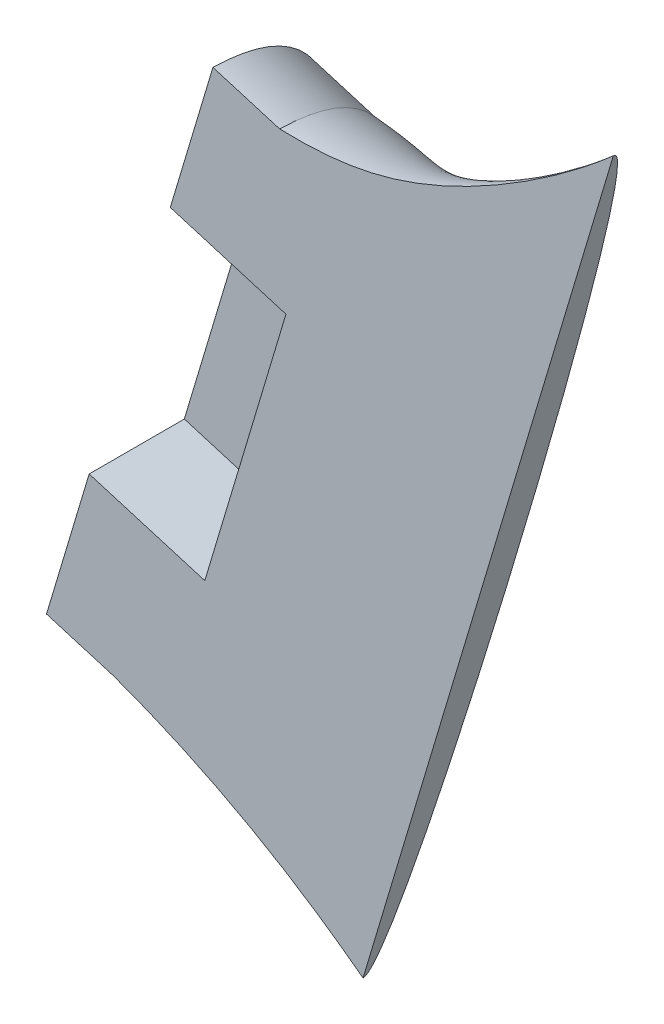
ISO-10303-21;
HEADER;
FILE_DESCRIPTION(('STEP AP214'),'2;1');
FILE_NAME('part.step','',(''),(''),'','','');
FILE_SCHEMA(('AUTOMOTIVE_DESIGN { 1 0 10303 214 1 1 1 1 }'));
ENDSEC;
DATA;
#1=APPLICATION_CONTEXT('core data for automotive mechanical design processes');
#2=APPLICATION_PROTOCOL_DEFINITION('international standard','automotive_design',2000,#1);
#3=PRODUCT_CONTEXT('',#1,'mechanical');
#4=PRODUCT('Part','Part','',(#3));
#5=PRODUCT_RELATED_PRODUCT_CATEGORY('part','',(#4));
#6=PRODUCT_DEFINITION_FORMATION('','',#4);
#7=PRODUCT_DEFINITION_CONTEXT('part definition',#1,'design');
#8=PRODUCT_DEFINITION('design','',#6,#7);
#9=PRODUCT_DEFINITION_SHAPE('','',#8);
#10=(LENGTH_UNIT() NAMED_UNIT(*) SI_UNIT(.MILLI.,.METRE.));
#11=(NAMED_UNIT(*) PLANE_ANGLE_UNIT() SI_UNIT($,.RADIAN.));
#12=(NAMED_UNIT(*) SI_UNIT($,.STERADIAN.) SOLID_ANGLE_UNIT());
#13=UNCERTAINTY_MEASURE_WITH_UNIT(LENGTH_MEASURE(1.E-05),#10,'distance_accuracy_value','');
#14=(GEOMETRIC_REPRESENTATION_CONTEXT(3) GLOBAL_UNCERTAINTY_ASSIGNED_CONTEXT((#13)) GLOBAL_UNIT_ASSIGNED_CONTEXT((#10,
#11,#12)) REPRESENTATION_CONTEXT('',''));
#15=CARTESIAN_POINT('',(0.,0.,0.));
#16=DIRECTION('',(0.,0.,1.));
#17=DIRECTION('',(1.,0.,0.));
#18=AXIS2_PLACEMENT_3D('',#15,#16,#17);
#19=CARTESIAN_POINT('',(-68.8351354727939,20.5796630643947,0.));
#20=DIRECTION('',(0.,0.,-1.));
#21=DIRECTION('',(1.,0.,0.));
#22=AXIS2_PLACEMENT_3D('',#19,#20,#21);
#23=PLANE('',#22);
#24=DIRECTION('',(-0.28644268795493,-0.958097378410543,0.));
#25=VECTOR('',#24,1.);
#26=CARTESIAN_POINT('',(-75.1754818984992,-8.30803292728945,0.));
#27=LINE('',#26,#25);
#28=CARTESIAN_POINT('',(-71.680881105449,3.38075508931917,0.));
#29=VERTEX_POINT('',#28);
#30=CARTESIAN_POINT('',(-75.1754818984992,-8.30803292728945,0.));
#31=VERTEX_POINT('',#30);
#32=EDGE_CURVE('E117',#29,#31,#27,.T.);
#33=ORIENTED_EDGE('',*,*,#32,.T.);
#34=DIRECTION('',(-0.958097378410543,0.28644268795493,0.));
#35=VECTOR('',#34,1.);
#36=CARTESIAN_POINT('',(-75.1754818984992,-8.30803292728945,0.));
#37=LINE('',#36,#35);
#38=CARTESIAN_POINT('',(-80.157588266234,-6.81853094992381,0.));
#39=VERTEX_POINT('',#38);
#40=EDGE_CURVE('E122',#31,#39,#37,.T.);
#41=ORIENTED_EDGE('',*,*,#40,.T.);
#42=DIRECTION('',(0.28644268795493,0.958097378410543,0.));
#43=VECTOR('',#42,1.);
#44=CARTESIAN_POINT('',(-71.7094276080255,21.4389911282595,0.));
#45=LINE('',#44,#43);
#46=CARTESIAN_POINT('',(-81.9945436836104,-12.9628042850572,0.));
#47=VERTEX_POINT('',#46);
#48=EDGE_CURVE('E226',#47,#39,#45,.T.);
#49=ORIENTED_EDGE('',*,*,#48,.F.);
#50=DIRECTION('',(-0.958097378410543,0.28644268795493,0.));
#51=VECTOR('',#50,1.);
#52=CARTESIAN_POINT('',(-79.1202515483788,-13.822132348922,0.));
#53=LINE('',#52,#51);
#54=CARTESIAN_POINT('',(-79.1202515483788,-13.822132348922,0.));
#55=VERTEX_POINT('',#54);
#56=EDGE_CURVE('E49',#55,#47,#53,.T.);
#57=ORIENTED_EDGE('',*,*,#56,.F.);
#58=CARTESIAN_POINT('',(-79.1202515483788,-13.822132348922,0.));
#59=CARTESIAN_POINT('',(-77.2430299362491,-14.4970734561594,0.));
#60=CARTESIAN_POINT('',(-73.2538280253343,-16.3282447215019,0.));
#61=CARTESIAN_POINT('',(-70.0691808052114,-18.4306839193362,0.));
#62=CARTESIAN_POINT('',(-68.3594778518222,-19.7225480436874,0.));
#63=B_SPLINE_CURVE_WITH_KNOTS('',3,(#58,#59,#60,#61,#62),.UNSPECIFIED.,.F.,.F.,(4,1,4),(0.,
0.464218351567374,1.),.UNSPECIFIED.);
#64=CARTESIAN_POINT('',(-68.3594778518222,-19.7225480436874,0.));
#65=VERTEX_POINT('',#64);
#66=EDGE_CURVE('E150',#55,#65,#63,.T.);
#67=ORIENTED_EDGE('',*,*,#66,.T.);
#68=DIRECTION('',(0.286442687954896,0.958097378410553,0.));
#69=VECTOR('',#68,1.);
#70=CARTESIAN_POINT('',(-68.3594778518222,-19.7225480436874,0.));
#71=LINE('',#70,#69);
#72=CARTESIAN_POINT('',(-57.5775416453369,16.3410180657399,0.));
#73=VERTEX_POINT('',#72);
#74=EDGE_CURVE('E197',#65,#73,#71,.T.);
#75=ORIENTED_EDGE('',*,*,#74,.T.);
#76=CARTESIAN_POINT('',(-71.9517399205758,10.1552023379534,0.));
#77=CARTESIAN_POINT('',(-69.5938616061763,10.0813238258005,0.));
#78=CARTESIAN_POINT('',(-65.4570985045668,10.7673698634453,0.));
#79=CARTESIAN_POINT('',(-60.011062756017,14.2052009776582,0.));
#80=CARTESIAN_POINT('',(-57.5775416453369,16.3410180657399,0.));
#81=B_SPLINE_CURVE_WITH_KNOTS('',3,(#76,#77,#78,#79,#80),.UNSPECIFIED.,.F.,.F.,(4,1,4),(0.,
0.464218351567374,1.),.UNSPECIFIED.);
#82=CARTESIAN_POINT('',(-71.9517399205758,10.1552023379534,0.));
#83=VERTEX_POINT('',#82);
#84=EDGE_CURVE('E144',#73,#83,#81,.F.);
#85=ORIENTED_EDGE('',*,*,#84,.T.);
#86=DIRECTION('',(-0.958097378410543,0.28644268795493,0.));
#87=VECTOR('',#86,1.);
#88=CARTESIAN_POINT('',(-71.9517399205758,10.1552023379534,-1.98715659294643E-13));
#89=LINE('',#88,#87);
#90=CARTESIAN_POINT('',(-74.8260320558074,11.0145304018182,-1.99959792391966E-13));
#91=VERTEX_POINT('',#90);
#92=EDGE_CURVE('E11',#83,#91,#89,.T.);
#93=ORIENTED_EDGE('',*,*,#92,.T.);
#94=CARTESIAN_POINT('',(-76.6629874731838,4.87025706668481,0.));
#95=VERTEX_POINT('',#94);
#96=EDGE_CURVE('E210',#95,#91,#45,.T.);
#97=ORIENTED_EDGE('',*,*,#96,.F.);
#98=DIRECTION('',(-0.958097378410543,0.28644268795493,0.));
#99=VECTOR('',#98,1.);
#100=CARTESIAN_POINT('',(-71.680881105449,3.38075508931917,0.));
#101=LINE('',#100,#99);
#102=EDGE_CURVE('E132',#29,#95,#101,.T.);
#103=ORIENTED_EDGE('',*,*,#102,.F.);
#104=EDGE_LOOP('',(#33,#41,#49,#57,#67,#75,#85,#93,#97,#103));
#105=FACE_BOUND('',#104,.T.);
#106=ADVANCED_FACE('F39',(#105),#23,.F.);
#107=CARTESIAN_POINT('',(-71.9517399205757,10.1552023379534,0.));
#108=CARTESIAN_POINT('',(-72.047540179021,9.83476833727145,-10.4883470019912));
#109=CARTESIAN_POINT('',(-78.9396589990728,-13.2180839464793,-10.3872504791322));
#110=CARTESIAN_POINT('',(-79.1202515483788,-13.822132348922,0.));
#111=B_SPLINE_CURVE_WITH_KNOTS('',3,(#107,#108,#109,#110),.UNSPECIFIED.,.F.,.F.,(4,4),(0.,1.),.UNSPECIFIED.);
#112=DIRECTION('',(-0.958097378410543,0.28644268795493,0.));
#113=VECTOR('',#112,1.);
#114=SURFACE_OF_LINEAR_EXTRUSION('',#111,#113);
#115=CARTESIAN_POINT('',(-74.8260320558074,11.0145304018182,0.));
#116=CARTESIAN_POINT('',(-74.9218323142527,10.6940964011362,-10.4883470019912));
#117=CARTESIAN_POINT('',(-81.8139511343044,-12.3587558826146,-10.3872504791322));
#118=CARTESIAN_POINT('',(-81.9945436836104,-12.9628042850572,0.));
#119=B_SPLINE_CURVE_WITH_KNOTS('',3,(#115,#116,#117,#118),.UNSPECIFIED.,.F.,.F.,(4,4),(0.,1.),.UNSPECIFIED.);
#120=EDGE_CURVE('E76',#91,#47,#119,.T.);
#121=ORIENTED_EDGE('',*,*,#120,.F.);
#122=ORIENTED_EDGE('',*,*,#92,.F.);
#123=CARTESIAN_POINT('',(-71.9517399205757,10.1552023379534,0.));
#124=CARTESIAN_POINT('',(-72.047540179021,9.83476833727145,-10.4883470019912));
#125=CARTESIAN_POINT('',(-78.9396589990728,-13.2180839464793,-10.3872504791322));
#126=CARTESIAN_POINT('',(-79.1202515483788,-13.822132348922,0.));
#127=B_SPLINE_CURVE_WITH_KNOTS('',3,(#123,#124,#125,#126),.UNSPECIFIED.,.F.,.F.,(4,4),(0.,1.),.UNSPECIFIED.);
#128=EDGE_CURVE('E66',#83,#55,#127,.T.);
#129=ORIENTED_EDGE('',*,*,#128,.T.);
#130=ORIENTED_EDGE('',*,*,#56,.T.);
#131=EDGE_LOOP('',(#121,#122,#129,#130));
#132=FACE_BOUND('',#131,.T.);
#133=ADVANCED_FACE('F231',(#132),#114,.T.);
#134=CARTESIAN_POINT('',(-71.7094276080255,21.4389911282595,0.));
#135=DIRECTION('',(0.958097378410543,-0.28644268795493,0.));
#136=DIRECTION('',(-0.28644268795493,-0.958097378410543,0.));
#137=AXIS2_PLACEMENT_3D('',#134,#135,#136);
#138=PLANE('',#137);
#139=ORIENTED_EDGE('',*,*,#96,.T.);
#140=ORIENTED_EDGE('',*,*,#120,.T.);
#141=ORIENTED_EDGE('',*,*,#48,.T.);
#142=DIRECTION('',(0.,0.,-1.));
#143=VECTOR('',#142,1.);
#144=CARTESIAN_POINT('',(-80.157588266234,-6.81853094992381,-4.10000000000003));
#145=LINE('',#144,#143);
#146=CARTESIAN_POINT('',(-80.157588266234,-6.81853094992381,-4.10000000000003));
#147=VERTEX_POINT('',#146);
#148=EDGE_CURVE('E57',#39,#147,#145,.T.);
#149=ORIENTED_EDGE('',*,*,#148,.T.);
#150=DIRECTION('',(0.28644268795493,0.958097378410543,0.));
#151=VECTOR('',#150,1.);
#152=CARTESIAN_POINT('',(-76.6629874731838,4.87025706668481,-4.10000000000003));
#153=LINE('',#152,#151);
#154=CARTESIAN_POINT('',(-76.6629874731838,4.87025706668481,-4.10000000000003));
#155=VERTEX_POINT('',#154);
#156=EDGE_CURVE('E135',#147,#155,#153,.T.);
#157=ORIENTED_EDGE('',*,*,#156,.T.);
#158=DIRECTION('',(0.,0.,1.));
#159=VECTOR('',#158,1.);
#160=CARTESIAN_POINT('',(-76.6629874731838,4.87025706668481,0.));
#161=LINE('',#160,#159);
#162=EDGE_CURVE('E133',#155,#95,#161,.T.);
#163=ORIENTED_EDGE('',*,*,#162,.T.);
#164=EDGE_LOOP('',(#139,#140,#141,#149,#157,#163));
#165=FACE_BOUND('',#164,.T.);
#166=ADVANCED_FACE('F234',(#165),#138,.F.);
#167=CARTESIAN_POINT('',(-62.9685097485796,-1.69076498897374,-1.27791279282263));
#168=DIRECTION('',(-0.958097378410553,0.286442687954896,0.));
#169=DIRECTION('',(0.286442687954896,0.958097378410553,0.));
#170=AXIS2_PLACEMENT_3D('',#167,#168,#169);
#171=PLANE('',#170);
#172=CARTESIAN_POINT('',(-57.5775416453369,16.3410180657399,0.));
#173=CARTESIAN_POINT('',(-57.5775416453369,16.3410180657399,-1.70388372376351));
#174=CARTESIAN_POINT('',(-68.3594778518222,-19.7225480436874,-1.70388372376351));
#175=CARTESIAN_POINT('',(-68.3594778518222,-19.7225480436874,0.));
#176=B_SPLINE_CURVE_WITH_KNOTS('',3,(#172,#173,#174,#175),.UNSPECIFIED.,.F.,.F.,(4,4),(0.,1.),.UNSPECIFIED.);
#177=EDGE_CURVE('E83',#73,#65,#176,.T.);
#178=ORIENTED_EDGE('',*,*,#177,.F.);
#179=ORIENTED_EDGE('',*,*,#74,.F.);
#180=EDGE_LOOP('',(#178,#179));
#181=FACE_BOUND('',#180,.T.);
#182=ADVANCED_FACE('F177',(#181),#171,.F.);
#183=CARTESIAN_POINT('',(-71.9517399205758,10.1552023379534,0.));
#184=CARTESIAN_POINT('',(-69.5938616061763,10.0813238258005,0.));
#185=CARTESIAN_POINT('',(-65.4570985045668,10.7673698634453,0.));
#186=CARTESIAN_POINT('',(-60.011062756017,14.2052009776582,0.));
#187=CARTESIAN_POINT('',(-57.5775416453369,16.3410180657399,0.));
#188=CARTESIAN_POINT('',(-72.0475401790211,9.83476833727143,-10.4883470019911));
#189=CARTESIAN_POINT('',(-69.8498807653782,9.56053562675707,-10.4883470019911));
#190=CARTESIAN_POINT('',(-65.4138783339914,10.5729305449382,-6.1919702156649));
#191=CARTESIAN_POINT('',(-59.76979003692,15.3477613818025,-1.70388372376351));
#192=CARTESIAN_POINT('',(-57.5775416453369,16.3410180657399,-1.70388372376351));
#193=CARTESIAN_POINT('',(-78.9396589990728,-13.2180839464794,-10.3872504791321));
#194=CARTESIAN_POINT('',(-76.9022184861865,-13.6926708553552,-10.3872504791321));
#195=CARTESIAN_POINT('',(-73.3459800759381,-16.2974734173909,-6.25031093128431));
#196=CARTESIAN_POINT('',(-70.3104535243084,-19.5732443234805,-1.70388372376351));
#197=CARTESIAN_POINT('',(-68.3594778518222,-19.7225480436874,-1.70388372376351));
#198=CARTESIAN_POINT('',(-79.1202515483788,-13.822132348922,0.));
#199=CARTESIAN_POINT('',(-77.2430299362491,-14.4970734561594,0.));
#200=CARTESIAN_POINT('',(-73.2538280253343,-16.3282447215019,0.));
#201=CARTESIAN_POINT('',(-70.0691808052114,-18.4306839193362,0.));
#202=CARTESIAN_POINT('',(-68.3594778518222,-19.7225480436874,0.));
#203=B_SPLINE_SURFACE_WITH_KNOTS('',3,3,((#183,#184,#185,#186,#187),(#188,#189,#190,#191,#192),
(#193,#194,#195,#196,#197),(#198,#199,#200,#201,#202)),.UNSPECIFIED.,.F.,.F.,.F.,(4,4),(4,1,4),
(0.,1.),(0.,0.464218351567374,1.),.UNSPECIFIED.);
#204=ORIENTED_EDGE('',*,*,#128,.F.);
#205=ORIENTED_EDGE('',*,*,#84,.F.);
#206=ORIENTED_EDGE('',*,*,#177,.T.);
#207=ORIENTED_EDGE('',*,*,#66,.F.);
#208=EDGE_LOOP('',(#204,#205,#206,#207));
#209=FACE_BOUND('',#208,.T.);
#210=ADVANCED_FACE('F164',(#209),#203,.F.);
#211=CARTESIAN_POINT('',(-71.680881105449,3.38075508931917,0.));
#212=DIRECTION('',(0.28644268795493,0.958097378410543,0.));
#213=DIRECTION('',(0.958097378410543,-0.28644268795493,0.));
#214=AXIS2_PLACEMENT_3D('',#211,#212,#213);
#215=PLANE('',#214);
#216=ORIENTED_EDGE('',*,*,#162,.F.);
#217=DIRECTION('',(-0.958097378410543,0.28644268795493,0.));
#218=VECTOR('',#217,1.);
#219=CARTESIAN_POINT('',(-71.680881105449,3.38075508931917,-4.10000000000003));
#220=LINE('',#219,#218);
#221=CARTESIAN_POINT('',(-71.680881105449,3.38075508931917,-4.10000000000003));
#222=VERTEX_POINT('',#221);
#223=EDGE_CURVE('E145',#222,#155,#220,.T.);
#224=ORIENTED_EDGE('',*,*,#223,.F.);
#225=DIRECTION('',(0.,0.,1.));
#226=VECTOR('',#225,1.);
#227=CARTESIAN_POINT('',(-71.680881105449,3.38075508931917,0.));
#228=LINE('',#227,#226);
#229=EDGE_CURVE('E127',#222,#29,#228,.T.);
#230=ORIENTED_EDGE('',*,*,#229,.T.);
#231=ORIENTED_EDGE('',*,*,#102,.T.);
#232=EDGE_LOOP('',(#216,#224,#230,#231));
#233=FACE_BOUND('',#232,.T.);
#234=ADVANCED_FACE('F176',(#233),#215,.F.);
#235=CARTESIAN_POINT('',(-71.680881105449,3.38075508931917,-4.10000000000003));
#236=DIRECTION('',(0.,0.,-1.));
#237=DIRECTION('',(1.,0.,0.));
#238=AXIS2_PLACEMENT_3D('',#235,#236,#237);
#239=PLANE('',#238);
#240=ORIENTED_EDGE('',*,*,#156,.F.);
#241=DIRECTION('',(-0.958097378410543,0.28644268795493,0.));
#242=VECTOR('',#241,1.);
#243=CARTESIAN_POINT('',(-75.1754818984992,-8.30803292728945,-4.10000000000003));
#244=LINE('',#243,#242);
#245=CARTESIAN_POINT('',(-75.1754818984992,-8.30803292728945,-4.10000000000003));
#246=VERTEX_POINT('',#245);
#247=EDGE_CURVE('E126',#246,#147,#244,.T.);
#248=ORIENTED_EDGE('',*,*,#247,.F.);
#249=DIRECTION('',(0.28644268795493,0.958097378410543,0.));
#250=VECTOR('',#249,1.);
#251=CARTESIAN_POINT('',(-71.680881105449,3.38075508931917,-4.10000000000003));
#252=LINE('',#251,#250);
#253=EDGE_CURVE('E118',#246,#222,#252,.T.);
#254=ORIENTED_EDGE('',*,*,#253,.T.);
#255=ORIENTED_EDGE('',*,*,#223,.T.);
#256=EDGE_LOOP('',(#240,#248,#254,#255));
#257=FACE_BOUND('',#256,.T.);
#258=ADVANCED_FACE('F281',(#257),#239,.F.);
#259=CARTESIAN_POINT('',(-75.1754818984992,-8.30803292728945,-4.10000000000003));
#260=DIRECTION('',(-0.28644268795493,-0.958097378410543,0.));
#261=DIRECTION('',(-0.958097378410543,0.28644268795493,0.));
#262=AXIS2_PLACEMENT_3D('',#259,#260,#261);
#263=PLANE('',#262);
#264=ORIENTED_EDGE('',*,*,#148,.F.);
#265=ORIENTED_EDGE('',*,*,#40,.F.);
#266=DIRECTION('',(0.,0.,-1.));
#267=VECTOR('',#266,1.);
#268=CARTESIAN_POINT('',(-75.1754818984992,-8.30803292728945,-4.10000000000003));
#269=LINE('',#268,#267);
#270=EDGE_CURVE('E113',#31,#246,#269,.T.);
#271=ORIENTED_EDGE('',*,*,#270,.T.);
#272=ORIENTED_EDGE('',*,*,#247,.T.);
#273=EDGE_LOOP('',(#264,#265,#271,#272));
#274=FACE_BOUND('',#273,.T.);
#275=ADVANCED_FACE('F123',(#274),#263,.F.);
#276=CARTESIAN_POINT('',(-66.7273212402907,19.9494891508938,0.));
#277=DIRECTION('',(0.958097378410543,-0.28644268795493,0.));
#278=DIRECTION('',(-0.28644268795493,-0.958097378410543,0.));
#279=AXIS2_PLACEMENT_3D('',#276,#277,#278);
#280=PLANE('',#279);
#281=ORIENTED_EDGE('',*,*,#32,.F.);
#282=ORIENTED_EDGE('',*,*,#229,.F.);
#283=ORIENTED_EDGE('',*,*,#253,.F.);
#284=ORIENTED_EDGE('',*,*,#270,.F.);
#285=EDGE_LOOP('',(#281,#282,#283,#284));
#286=FACE_BOUND('',#285,.T.);
#287=ADVANCED_FACE('F114',(#286),#280,.F.);
#288=CLOSED_SHELL('',(#106,#133,#166,#182,#210,#234,#258,#275,#287));
#289=MANIFOLD_SOLID_BREP('B2',#288);
#290=ADVANCED_BREP_SHAPE_REPRESENTATION('',(#18,#289),#14);
#291=SHAPE_DEFINITION_REPRESENTATION(#9,#290);
ENDSEC;
END-ISO-10303-21;
